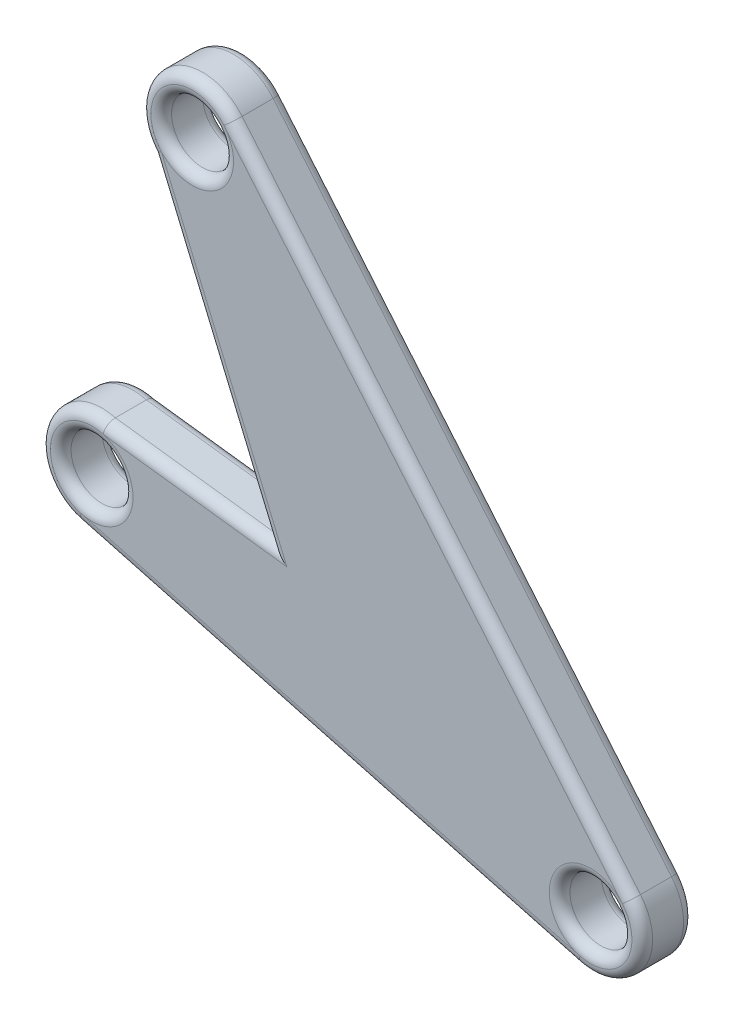
ISO-10303-21;
HEADER;
FILE_DESCRIPTION(('STEP AP214'),'2;1');
FILE_NAME('part.step','',(''),(''),'','','');
FILE_SCHEMA(('AUTOMOTIVE_DESIGN { 1 0 10303 214 1 1 1 1 }'));
ENDSEC;
DATA;
#1=APPLICATION_CONTEXT('core data for automotive mechanical design processes');
#2=APPLICATION_PROTOCOL_DEFINITION('international standard','automotive_design',2000,#1);
#3=PRODUCT_CONTEXT('',#1,'mechanical');
#4=PRODUCT('Part','Part','',(#3));
#5=PRODUCT_RELATED_PRODUCT_CATEGORY('part','',(#4));
#6=PRODUCT_DEFINITION_FORMATION('','',#4);
#7=PRODUCT_DEFINITION_CONTEXT('part definition',#1,'design');
#8=PRODUCT_DEFINITION('design','',#6,#7);
#9=PRODUCT_DEFINITION_SHAPE('','',#8);
#10=(LENGTH_UNIT() NAMED_UNIT(*) SI_UNIT(.MILLI.,.METRE.));
#11=(NAMED_UNIT(*) PLANE_ANGLE_UNIT() SI_UNIT($,.RADIAN.));
#12=(NAMED_UNIT(*) SI_UNIT($,.STERADIAN.) SOLID_ANGLE_UNIT());
#13=UNCERTAINTY_MEASURE_WITH_UNIT(LENGTH_MEASURE(1.E-05),#10,'distance_accuracy_value','');
#14=(GEOMETRIC_REPRESENTATION_CONTEXT(3) GLOBAL_UNCERTAINTY_ASSIGNED_CONTEXT((#13)) GLOBAL_UNIT_ASSIGNED_CONTEXT((#10,
#11,#12)) REPRESENTATION_CONTEXT('',''));
#15=CARTESIAN_POINT('',(0.,0.,0.));
#16=DIRECTION('',(0.,0.,1.));
#17=DIRECTION('',(1.,0.,0.));
#18=AXIS2_PLACEMENT_3D('',#15,#16,#17);
#19=CARTESIAN_POINT('',(-0.647047612756279,-2.41481456572268,2.5));
#20=DIRECTION('',(0.258819045102511,0.965925826289071,0.));
#21=DIRECTION('',(-0.965925826289071,0.258819045102511,0.));
#22=AXIS2_PLACEMENT_3D('',#19,#20,#21);
#23=PLANE('',#22);
#24=DIRECTION('',(0.,0.,-1.));
#25=VECTOR('',#24,1.);
#26=CARTESIAN_POINT('',(-24.7951932699831,4.0556615618401,2.5));
#27=LINE('',#26,#25);
#28=CARTESIAN_POINT('',(-24.7951932699831,4.0556615618401,2.));
#29=VERTEX_POINT('',#28);
#30=CARTESIAN_POINT('',(-24.7951932699831,4.0556615618401,0.5));
#31=VERTEX_POINT('',#30);
#32=EDGE_CURVE('E432',#29,#31,#27,.T.);
#33=ORIENTED_EDGE('',*,*,#32,.T.);
#34=DIRECTION('',(0.965925826289071,-0.258819045102511,0.));
#35=VECTOR('',#34,1.);
#36=CARTESIAN_POINT('',(-0.647047612756279,-2.41481456572268,0.5));
#37=LINE('',#36,#35);
#38=CARTESIAN_POINT('',(-0.647047612756279,-2.41481456572268,0.5));
#39=VERTEX_POINT('',#38);
#40=EDGE_CURVE('E245',#31,#39,#37,.T.);
#41=ORIENTED_EDGE('',*,*,#40,.T.);
#42=DIRECTION('',(0.,0.,-1.));
#43=VECTOR('',#42,1.);
#44=CARTESIAN_POINT('',(-0.647047612756279,-2.41481456572268,2.5));
#45=LINE('',#44,#43);
#46=CARTESIAN_POINT('',(-0.647047612756279,-2.41481456572268,2.));
#47=VERTEX_POINT('',#46);
#48=EDGE_CURVE('E181',#47,#39,#45,.T.);
#49=ORIENTED_EDGE('',*,*,#48,.F.);
#50=DIRECTION('',(0.965925826289071,-0.258819045102511,0.));
#51=VECTOR('',#50,1.);
#52=CARTESIAN_POINT('',(-24.7951932699831,4.05566156184011,2.));
#53=LINE('',#52,#51);
#54=EDGE_CURVE('E243',#47,#29,#53,.F.);
#55=ORIENTED_EDGE('',*,*,#54,.T.);
#56=EDGE_LOOP('',(#33,#41,#49,#55));
#57=FACE_BOUND('',#56,.T.);
#58=ADVANCED_FACE('F43',(#57),#23,.F.);
#59=CARTESIAN_POINT('',(0.,0.,2.5));
#60=DIRECTION('',(0.,0.,-1.));
#61=DIRECTION('',(-1.,0.,0.));
#62=AXIS2_PLACEMENT_3D('',#59,#60,#61);
#63=CYLINDRICAL_SURFACE('',#62,2.5);
#64=ORIENTED_EDGE('',*,*,#48,.T.);
#65=CARTESIAN_POINT('',(0.,0.,0.5));
#66=DIRECTION('',(0.,0.,1.));
#67=DIRECTION('',(1.,0.,0.));
#68=AXIS2_PLACEMENT_3D('',#65,#66,#67);
#69=CIRCLE('',#68,2.5);
#70=CARTESIAN_POINT('',(1.91511110779743,1.60696902421637,0.5));
#71=VERTEX_POINT('',#70);
#72=EDGE_CURVE('E168',#39,#71,#69,.T.);
#73=ORIENTED_EDGE('',*,*,#72,.T.);
#74=DIRECTION('',(0.,0.,-1.));
#75=VECTOR('',#74,1.);
#76=CARTESIAN_POINT('',(1.91511110779743,1.60696902421637,2.5));
#77=LINE('',#76,#75);
#78=CARTESIAN_POINT('',(1.91511110779743,1.60696902421637,2.));
#79=VERTEX_POINT('',#78);
#80=EDGE_CURVE('E445',#79,#71,#77,.T.);
#81=ORIENTED_EDGE('',*,*,#80,.F.);
#82=CARTESIAN_POINT('',(0.,0.,2.));
#83=DIRECTION('',(0.,0.,1.));
#84=DIRECTION('',(1.,0.,0.));
#85=AXIS2_PLACEMENT_3D('',#82,#83,#84);
#86=CIRCLE('',#85,2.5);
#87=EDGE_CURVE('E219',#79,#47,#86,.F.);
#88=ORIENTED_EDGE('',*,*,#87,.T.);
#89=EDGE_LOOP('',(#64,#73,#81,#88));
#90=FACE_BOUND('',#89,.T.);
#91=ADVANCED_FACE('F369',(#90),#63,.T.);
#92=CARTESIAN_POINT('',(1.91511110779743,1.60696902421637,2.5));
#93=DIRECTION('',(-0.766044443118973,-0.642787609686546,0.));
#94=DIRECTION('',(0.642787609686546,-0.766044443118973,0.));
#95=AXIS2_PLACEMENT_3D('',#92,#93,#94);
#96=PLANE('',#95);
#97=ORIENTED_EDGE('',*,*,#80,.T.);
#98=DIRECTION('',(-0.642787609686546,0.766044443118973,0.));
#99=VECTOR('',#98,1.);
#100=CARTESIAN_POINT('',(1.91511110779743,1.60696902421637,0.5));
#101=LINE('',#100,#99);
#102=CARTESIAN_POINT('',(-17.3685171827989,24.5883023177855,0.5));
#103=VERTEX_POINT('',#102);
#104=EDGE_CURVE('E224',#71,#103,#101,.T.);
#105=ORIENTED_EDGE('',*,*,#104,.T.);
#106=DIRECTION('',(0.,0.,-1.));
#107=VECTOR('',#106,1.);
#108=CARTESIAN_POINT('',(-17.3685171827989,24.5883023177855,2.5));
#109=LINE('',#108,#107);
#110=CARTESIAN_POINT('',(-17.3685171827989,24.5883023177855,2.));
#111=VERTEX_POINT('',#110);
#112=EDGE_CURVE('E442',#111,#103,#109,.T.);
#113=ORIENTED_EDGE('',*,*,#112,.F.);
#114=DIRECTION('',(-0.642787609686546,0.766044443118973,0.));
#115=VECTOR('',#114,1.);
#116=CARTESIAN_POINT('',(1.91511110779743,1.60696902421637,2.));
#117=LINE('',#116,#115);
#118=EDGE_CURVE('E222',#111,#79,#117,.F.);
#119=ORIENTED_EDGE('',*,*,#118,.T.);
#120=EDGE_LOOP('',(#97,#105,#113,#119));
#121=FACE_BOUND('',#120,.T.);
#122=ADVANCED_FACE('F375',(#121),#96,.F.);
#123=CARTESIAN_POINT('',(-19.2836282905964,22.9813332935692,2.5));
#124=DIRECTION('',(0.,0.,-1.));
#125=DIRECTION('',(-1.,0.,0.));
#126=AXIS2_PLACEMENT_3D('',#123,#124,#125);
#127=CYLINDRICAL_SURFACE('',#126,2.5);
#128=ORIENTED_EDGE('',*,*,#112,.T.);
#129=CARTESIAN_POINT('',(-19.2836282905964,22.9813332935692,0.5));
#130=DIRECTION('',(0.,0.,1.));
#131=DIRECTION('',(1.,0.,0.));
#132=AXIS2_PLACEMENT_3D('',#129,#130,#131);
#133=CIRCLE('',#132,2.5);
#134=CARTESIAN_POINT('',(-21.1987393983938,21.3743642693528,0.5));
#135=VERTEX_POINT('',#134);
#136=EDGE_CURVE('E228',#103,#135,#133,.T.);
#137=ORIENTED_EDGE('',*,*,#136,.T.);
#138=DIRECTION('',(0.,0.,-1.));
#139=VECTOR('',#138,1.);
#140=CARTESIAN_POINT('',(-21.1987393983938,21.3743642693528,2.5));
#141=LINE('',#140,#139);
#142=CARTESIAN_POINT('',(-21.1987393983938,21.3743642693528,2.));
#143=VERTEX_POINT('',#142);
#144=EDGE_CURVE('E413',#143,#135,#141,.T.);
#145=ORIENTED_EDGE('',*,*,#144,.F.);
#146=CARTESIAN_POINT('',(-19.2836282905964,22.9813332935692,2.));
#147=DIRECTION('',(0.,0.,1.));
#148=DIRECTION('',(1.,0.,0.));
#149=AXIS2_PLACEMENT_3D('',#146,#147,#148);
#150=CIRCLE('',#149,2.5);
#151=EDGE_CURVE('E226',#143,#111,#150,.F.);
#152=ORIENTED_EDGE('',*,*,#151,.T.);
#153=EDGE_LOOP('',(#128,#137,#145,#152));
#154=FACE_BOUND('',#153,.T.);
#155=ADVANCED_FACE('F493',(#154),#127,.T.);
#156=CARTESIAN_POINT('',(-10.3243914845816,-4.3622991514506,2.5));
#157=DIRECTION('',(-0.921150047944264,-0.38920764274649,0.));
#158=DIRECTION('',(0.38920764274649,-0.921150047944264,0.));
#159=AXIS2_PLACEMENT_3D('',#156,#157,#158);
#160=PLANE('',#159);
#161=ORIENTED_EDGE('',*,*,#144,.T.);
#162=DIRECTION('',(-0.38920764274649,0.921150047944264,0.));
#163=VECTOR('',#162,1.);
#164=CARTESIAN_POINT('',(-15.5010980444705,7.88957612567752,0.5));
#165=LINE('',#164,#163);
#166=CARTESIAN_POINT('',(-15.5010980444705,7.88957612567752,0.5));
#167=VERTEX_POINT('',#166);
#168=EDGE_CURVE('E232',#135,#167,#165,.F.);
#169=ORIENTED_EDGE('',*,*,#168,.T.);
#170=DIRECTION('',(0.,0.,-1.));
#171=VECTOR('',#170,1.);
#172=CARTESIAN_POINT('',(-15.5010980444705,7.88957612567752,2.5));
#173=LINE('',#172,#171);
#174=CARTESIAN_POINT('',(-15.5010980444705,7.88957612567752,2.));
#175=VERTEX_POINT('',#174);
#176=EDGE_CURVE('E410',#175,#167,#173,.T.);
#177=ORIENTED_EDGE('',*,*,#176,.F.);
#178=DIRECTION('',(-0.38920764274649,0.921150047944264,0.));
#179=VECTOR('',#178,1.);
#180=CARTESIAN_POINT('',(-10.3243914845816,-4.3622991514506,2.));
#181=LINE('',#180,#179);
#182=EDGE_CURVE('E230',#175,#143,#181,.T.);
#183=ORIENTED_EDGE('',*,*,#182,.T.);
#184=EDGE_LOOP('',(#161,#169,#177,#183));
#185=FACE_BOUND('',#184,.T.);
#186=ADVANCED_FACE('F409',(#185),#160,.T.);
#187=CARTESIAN_POINT('',(0.73052076796544,5.86931871225232,2.5));
#188=DIRECTION('',(0.123511318006618,0.992343163590231,0.));
#189=DIRECTION('',(-0.992343163590231,0.123511318006618,0.));
#190=AXIS2_PLACEMENT_3D('',#187,#188,#189);
#191=PLANE('',#190);
#192=ORIENTED_EDGE('',*,*,#176,.T.);
#193=DIRECTION('',(0.992343163590231,-0.123511318006618,0.));
#194=VECTOR('',#193,1.);
#195=CARTESIAN_POINT('',(-23.5010980444705,8.88529069328546,0.5));
#196=LINE('',#195,#194);
#197=CARTESIAN_POINT('',(-23.5010980444705,8.88529069328546,0.5));
#198=VERTEX_POINT('',#197);
#199=EDGE_CURVE('E236',#167,#198,#196,.F.);
#200=ORIENTED_EDGE('',*,*,#199,.T.);
#201=DIRECTION('',(0.,0.,-1.));
#202=VECTOR('',#201,1.);
#203=CARTESIAN_POINT('',(-23.5010980444705,8.88529069328546,2.5));
#204=LINE('',#203,#202);
#205=CARTESIAN_POINT('',(-23.5010980444705,8.88529069328546,2.));
#206=VERTEX_POINT('',#205);
#207=EDGE_CURVE('E420',#206,#198,#204,.T.);
#208=ORIENTED_EDGE('',*,*,#207,.F.);
#209=DIRECTION('',(0.992343163590231,-0.123511318006618,0.));
#210=VECTOR('',#209,1.);
#211=CARTESIAN_POINT('',(0.73052076796544,5.86931871225232,2.));
#212=LINE('',#211,#210);
#213=EDGE_CURVE('E234',#206,#175,#212,.T.);
#214=ORIENTED_EDGE('',*,*,#213,.T.);
#215=EDGE_LOOP('',(#192,#200,#208,#214));
#216=FACE_BOUND('',#215,.T.);
#217=ADVANCED_FACE('F416',(#216),#191,.T.);
#218=CARTESIAN_POINT('',(-24.1481456572268,6.47047612756278,2.5));
#219=DIRECTION('',(0.,0.,-1.));
#220=DIRECTION('',(-1.,0.,0.));
#221=AXIS2_PLACEMENT_3D('',#218,#219,#220);
#222=CYLINDRICAL_SURFACE('',#221,1.5);
#223=CARTESIAN_POINT('',(-24.1481456572268,6.47047612756278,0.5));
#224=DIRECTION('',(0.,0.,1.));
#225=DIRECTION('',(1.,0.,0.));
#226=AXIS2_PLACEMENT_3D('',#223,#224,#225);
#227=CIRCLE('',#226,1.5);
#228=CARTESIAN_POINT('',(-22.6481456572268,6.47047612756278,0.5));
#229=VERTEX_POINT('',#228);
#230=EDGE_CURVE('E210',#229,#229,#227,.F.);
#231=ORIENTED_EDGE('',*,*,#230,.T.);
#232=EDGE_LOOP('',(#231));
#233=FACE_BOUND('',#232,.T.);
#234=CARTESIAN_POINT('',(-24.1481456572268,6.47047612756278,2.));
#235=DIRECTION('',(0.,0.,1.));
#236=DIRECTION('',(1.,0.,0.));
#237=AXIS2_PLACEMENT_3D('',#234,#235,#236);
#238=CIRCLE('',#237,1.5);
#239=CARTESIAN_POINT('',(-22.6481456572268,6.47047612756278,2.));
#240=VERTEX_POINT('',#239);
#241=EDGE_CURVE('E207',#240,#240,#238,.T.);
#242=ORIENTED_EDGE('',*,*,#241,.T.);
#243=EDGE_LOOP('',(#242));
#244=FACE_BOUND('',#243,.T.);
#245=ADVANCED_FACE('F504',(#233,#244),#222,.F.);
#246=CARTESIAN_POINT('',(-19.2836282905964,22.9813332935692,2.5));
#247=DIRECTION('',(0.,0.,-1.));
#248=DIRECTION('',(-1.,0.,0.));
#249=AXIS2_PLACEMENT_3D('',#246,#247,#248);
#250=CYLINDRICAL_SURFACE('',#249,1.5);
#251=CARTESIAN_POINT('',(-19.2836282905964,22.9813332935692,0.5));
#252=DIRECTION('',(0.,0.,1.));
#253=DIRECTION('',(1.,0.,0.));
#254=AXIS2_PLACEMENT_3D('',#251,#252,#253);
#255=CIRCLE('',#254,1.5);
#256=CARTESIAN_POINT('',(-17.7836282905964,22.9813332935692,0.5));
#257=VERTEX_POINT('',#256);
#258=EDGE_CURVE('E216',#257,#257,#255,.F.);
#259=ORIENTED_EDGE('',*,*,#258,.T.);
#260=EDGE_LOOP('',(#259));
#261=FACE_BOUND('',#260,.T.);
#262=CARTESIAN_POINT('',(-19.2836282905964,22.9813332935692,2.));
#263=DIRECTION('',(0.,0.,1.));
#264=DIRECTION('',(1.,0.,0.));
#265=AXIS2_PLACEMENT_3D('',#262,#263,#264);
#266=CIRCLE('',#265,1.5);
#267=CARTESIAN_POINT('',(-17.7836282905964,22.9813332935692,2.));
#268=VERTEX_POINT('',#267);
#269=EDGE_CURVE('E213',#268,#268,#266,.T.);
#270=ORIENTED_EDGE('',*,*,#269,.T.);
#271=EDGE_LOOP('',(#270));
#272=FACE_BOUND('',#271,.T.);
#273=ADVANCED_FACE('F508',(#261,#272),#250,.F.);
#274=CARTESIAN_POINT('',(-24.1481456572268,6.47047612756278,2.5));
#275=DIRECTION('',(0.,0.,-1.));
#276=DIRECTION('',(-1.,0.,0.));
#277=AXIS2_PLACEMENT_3D('',#274,#275,#276);
#278=CYLINDRICAL_SURFACE('',#277,2.5);
#279=ORIENTED_EDGE('',*,*,#207,.T.);
#280=CARTESIAN_POINT('',(-24.1481456572268,6.47047612756278,0.5));
#281=DIRECTION('',(0.,0.,1.));
#282=DIRECTION('',(1.,0.,0.));
#283=AXIS2_PLACEMENT_3D('',#280,#281,#282);
#284=CIRCLE('',#283,2.5);
#285=EDGE_CURVE('E241',#198,#31,#284,.T.);
#286=ORIENTED_EDGE('',*,*,#285,.T.);
#287=ORIENTED_EDGE('',*,*,#32,.F.);
#288=CARTESIAN_POINT('',(-24.1481456572268,6.47047612756278,2.));
#289=DIRECTION('',(0.,0.,1.));
#290=DIRECTION('',(1.,0.,0.));
#291=AXIS2_PLACEMENT_3D('',#288,#289,#290);
#292=CIRCLE('',#291,2.5);
#293=EDGE_CURVE('E238',#29,#206,#292,.F.);
#294=ORIENTED_EDGE('',*,*,#293,.T.);
#295=EDGE_LOOP('',(#279,#286,#287,#294));
#296=FACE_BOUND('',#295,.T.);
#297=ADVANCED_FACE('F431',(#296),#278,.T.);
#298=CARTESIAN_POINT('',(0.,0.,2.5));
#299=DIRECTION('',(0.,0.,-1.));
#300=DIRECTION('',(-1.,0.,0.));
#301=AXIS2_PLACEMENT_3D('',#298,#299,#300);
#302=CYLINDRICAL_SURFACE('',#301,1.5);
#303=CARTESIAN_POINT('',(0.,0.,0.5));
#304=DIRECTION('',(0.,0.,1.));
#305=DIRECTION('',(1.,0.,0.));
#306=AXIS2_PLACEMENT_3D('',#303,#304,#305);
#307=CIRCLE('',#306,1.5);
#308=CARTESIAN_POINT('',(1.5,0.,0.5));
#309=VERTEX_POINT('',#308);
#310=EDGE_CURVE('E204',#309,#309,#307,.F.);
#311=ORIENTED_EDGE('',*,*,#310,.T.);
#312=EDGE_LOOP('',(#311));
#313=FACE_BOUND('',#312,.T.);
#314=CARTESIAN_POINT('',(0.,0.,2.));
#315=DIRECTION('',(0.,0.,1.));
#316=DIRECTION('',(1.,0.,0.));
#317=AXIS2_PLACEMENT_3D('',#314,#315,#316);
#318=CIRCLE('',#317,1.5);
#319=CARTESIAN_POINT('',(1.5,0.,2.));
#320=VERTEX_POINT('',#319);
#321=EDGE_CURVE('E201',#320,#320,#318,.T.);
#322=ORIENTED_EDGE('',*,*,#321,.T.);
#323=EDGE_LOOP('',(#322));
#324=FACE_BOUND('',#323,.T.);
#325=ADVANCED_FACE('F507',(#313,#324),#302,.F.);
#326=CARTESIAN_POINT('',(0.,0.,2.5));
#327=DIRECTION('',(0.,0.,1.));
#328=DIRECTION('',(1.,0.,0.));
#329=AXIS2_PLACEMENT_3D('',#326,#327,#328);
#330=PLANE('',#329);
#331=DIRECTION('',(-0.38920764274649,0.921150047944264,0.));
#332=VECTOR('',#331,1.);
#333=CARTESIAN_POINT('',(-9.86381646060947,-4.16769533007736,2.5));
#334=LINE('',#333,#332);
#335=CARTESIAN_POINT('',(-20.7690839423935,21.6421464109631,2.5));
#336=VERTEX_POINT('',#335);
#337=CARTESIAN_POINT('',(-14.7034593145328,7.28644060483377,2.5));
#338=VERTEX_POINT('',#337);
#339=EDGE_CURVE('E52',#336,#338,#334,.F.);
#340=ORIENTED_EDGE('',*,*,#339,.T.);
#341=DIRECTION('',(0.992343163590231,-0.123511318006618,0.));
#342=VECTOR('',#341,1.);
#343=CARTESIAN_POINT('',(0.668765108962131,5.37314713045721,2.5));
#344=LINE('',#343,#342);
#345=CARTESIAN_POINT('',(-23.5990577101027,8.39362521859112,2.5));
#346=VERTEX_POINT('',#345);
#347=EDGE_CURVE('E11',#338,#346,#344,.F.);
#348=ORIENTED_EDGE('',*,*,#347,.T.);
#349=CARTESIAN_POINT('',(-24.1481456572268,6.47047612756278,2.5));
#350=DIRECTION('',(0.,0.,1.));
#351=DIRECTION('',(1.,0.,0.));
#352=AXIS2_PLACEMENT_3D('',#349,#350,#351);
#353=CIRCLE('',#352,2.);
#354=CARTESIAN_POINT('',(-22.1481456572268,6.47047612756278,2.5));
#355=VERTEX_POINT('',#354);
#356=EDGE_CURVE('E260',#346,#355,#353,.F.);
#357=ORIENTED_EDGE('',*,*,#356,.T.);
#358=CARTESIAN_POINT('',(-24.1481456572268,6.47047612756278,2.5));
#359=DIRECTION('',(0.,0.,1.));
#360=DIRECTION('',(1.,0.,0.));
#361=AXIS2_PLACEMENT_3D('',#358,#359,#360);
#362=CIRCLE('',#361,2.);
#363=CARTESIAN_POINT('',(-24.6657837474318,4.53862447498464,2.5));
#364=VERTEX_POINT('',#363);
#365=EDGE_CURVE('E249',#355,#364,#362,.F.);
#366=ORIENTED_EDGE('',*,*,#365,.T.);
#367=DIRECTION('',(0.965925826289071,-0.258819045102511,0.));
#368=VECTOR('',#367,1.);
#369=CARTESIAN_POINT('',(-0.517638090205023,-1.93185165257814,2.5));
#370=LINE('',#369,#368);
#371=CARTESIAN_POINT('',(-0.517638090205023,-1.93185165257814,2.5));
#372=VERTEX_POINT('',#371);
#373=EDGE_CURVE('E247',#364,#372,#370,.T.);
#374=ORIENTED_EDGE('',*,*,#373,.T.);
#375=CARTESIAN_POINT('',(0.,0.,2.5));
#376=DIRECTION('',(0.,0.,1.));
#377=DIRECTION('',(1.,0.,0.));
#378=AXIS2_PLACEMENT_3D('',#375,#376,#377);
#379=CIRCLE('',#378,2.);
#380=CARTESIAN_POINT('',(1.53208888623795,1.28557521937309,2.5));
#381=VERTEX_POINT('',#380);
#382=EDGE_CURVE('E251',#372,#381,#379,.F.);
#383=ORIENTED_EDGE('',*,*,#382,.T.);
#384=DIRECTION('',(-0.642787609686546,0.766044443118973,0.));
#385=VECTOR('',#384,1.);
#386=CARTESIAN_POINT('',(-17.7515394043584,24.2669085129423,2.5));
#387=LINE('',#386,#385);
#388=CARTESIAN_POINT('',(-17.7515394043584,24.2669085129423,2.5));
#389=VERTEX_POINT('',#388);
#390=EDGE_CURVE('E254',#381,#389,#387,.T.);
#391=ORIENTED_EDGE('',*,*,#390,.T.);
#392=CARTESIAN_POINT('',(-19.2836282905964,22.9813332935692,2.5));
#393=DIRECTION('',(0.,0.,1.));
#394=DIRECTION('',(1.,0.,0.));
#395=AXIS2_PLACEMENT_3D('',#392,#393,#394);
#396=CIRCLE('',#395,2.);
#397=CARTESIAN_POINT('',(-17.2836282905964,22.9813332935692,2.5));
#398=VERTEX_POINT('',#397);
#399=EDGE_CURVE('E256',#389,#398,#396,.F.);
#400=ORIENTED_EDGE('',*,*,#399,.T.);
#401=CARTESIAN_POINT('',(-19.2836282905964,22.9813332935692,2.5));
#402=DIRECTION('',(0.,0.,1.));
#403=DIRECTION('',(1.,0.,0.));
#404=AXIS2_PLACEMENT_3D('',#401,#402,#403);
#405=CIRCLE('',#404,2.);
#406=EDGE_CURVE('E258',#398,#336,#405,.F.);
#407=ORIENTED_EDGE('',*,*,#406,.T.);
#408=EDGE_LOOP('',(#340,#348,#357,#366,#374,#383,#391,#400,#407));
#409=FACE_BOUND('',#408,.T.);
#410=ADVANCED_FACE('F475',(#409),#330,.T.);
#411=CARTESIAN_POINT('',(0.,0.,0.));
#412=DIRECTION('',(0.,0.,1.));
#413=DIRECTION('',(1.,0.,0.));
#414=AXIS2_PLACEMENT_3D('',#411,#412,#413);
#415=PLANE('',#414);
#416=CARTESIAN_POINT('',(-19.2836282905964,22.9813332935692,0.));
#417=DIRECTION('',(0.,0.,1.));
#418=DIRECTION('',(1.,0.,0.));
#419=AXIS2_PLACEMENT_3D('',#416,#417,#418);
#420=CIRCLE('',#419,2.);
#421=CARTESIAN_POINT('',(-20.7690839423934,21.6421464109631,0.));
#422=VERTEX_POINT('',#421);
#423=CARTESIAN_POINT('',(-17.2836282905964,22.9813332935692,0.));
#424=VERTEX_POINT('',#423);
#425=EDGE_CURVE('E197',#422,#424,#420,.T.);
#426=ORIENTED_EDGE('',*,*,#425,.T.);
#427=CARTESIAN_POINT('',(-19.2836282905964,22.9813332935692,0.));
#428=DIRECTION('',(0.,0.,1.));
#429=DIRECTION('',(1.,0.,0.));
#430=AXIS2_PLACEMENT_3D('',#427,#428,#429);
#431=CIRCLE('',#430,2.);
#432=CARTESIAN_POINT('',(-17.7515394043584,24.2669085129423,0.));
#433=VERTEX_POINT('',#432);
#434=EDGE_CURVE('E199',#424,#433,#431,.T.);
#435=ORIENTED_EDGE('',*,*,#434,.T.);
#436=DIRECTION('',(-0.642787609686546,0.766044443118973,0.));
#437=VECTOR('',#436,1.);
#438=CARTESIAN_POINT('',(1.53208888623795,1.28557521937309,0.));
#439=LINE('',#438,#437);
#440=CARTESIAN_POINT('',(1.53208888623795,1.28557521937309,0.));
#441=VERTEX_POINT('',#440);
#442=EDGE_CURVE('E185',#433,#441,#439,.F.);
#443=ORIENTED_EDGE('',*,*,#442,.T.);
#444=CARTESIAN_POINT('',(0.,0.,0.));
#445=DIRECTION('',(0.,0.,1.));
#446=DIRECTION('',(1.,0.,0.));
#447=AXIS2_PLACEMENT_3D('',#444,#445,#446);
#448=CIRCLE('',#447,2.);
#449=CARTESIAN_POINT('',(-0.517638090205023,-1.93185165257814,0.));
#450=VERTEX_POINT('',#449);
#451=EDGE_CURVE('E158',#441,#450,#448,.T.);
#452=ORIENTED_EDGE('',*,*,#451,.T.);
#453=DIRECTION('',(0.965925826289071,-0.258819045102511,0.));
#454=VECTOR('',#453,1.);
#455=CARTESIAN_POINT('',(-0.517638090205023,-1.93185165257814,0.));
#456=LINE('',#455,#454);
#457=CARTESIAN_POINT('',(-24.6657837474318,4.53862447498464,0.));
#458=VERTEX_POINT('',#457);
#459=EDGE_CURVE('E174',#450,#458,#456,.F.);
#460=ORIENTED_EDGE('',*,*,#459,.T.);
#461=CARTESIAN_POINT('',(-24.1481456572268,6.47047612756278,0.));
#462=DIRECTION('',(0.,0.,1.));
#463=DIRECTION('',(1.,0.,0.));
#464=AXIS2_PLACEMENT_3D('',#461,#462,#463);
#465=CIRCLE('',#464,2.);
#466=CARTESIAN_POINT('',(-22.1481456572268,6.47047612756278,0.));
#467=VERTEX_POINT('',#466);
#468=EDGE_CURVE('E180',#458,#467,#465,.T.);
#469=ORIENTED_EDGE('',*,*,#468,.T.);
#470=CARTESIAN_POINT('',(-24.1481456572268,6.47047612756278,0.));
#471=DIRECTION('',(0.,0.,1.));
#472=DIRECTION('',(1.,0.,0.));
#473=AXIS2_PLACEMENT_3D('',#470,#471,#472);
#474=CIRCLE('',#473,2.);
#475=CARTESIAN_POINT('',(-23.5990577101027,8.39362521859112,0.));
#476=VERTEX_POINT('',#475);
#477=EDGE_CURVE('E188',#467,#476,#474,.T.);
#478=ORIENTED_EDGE('',*,*,#477,.T.);
#479=DIRECTION('',(0.992343163590231,-0.123511318006618,0.));
#480=VECTOR('',#479,1.);
#481=CARTESIAN_POINT('',(-15.5628537034738,7.3934045438824,0.));
#482=LINE('',#481,#480);
#483=CARTESIAN_POINT('',(-14.7034593145328,7.28644060483377,0.));
#484=VERTEX_POINT('',#483);
#485=EDGE_CURVE('E187',#476,#484,#482,.T.);
#486=ORIENTED_EDGE('',*,*,#485,.T.);
#487=DIRECTION('',(-0.38920764274649,0.921150047944264,0.));
#488=VECTOR('',#487,1.);
#489=CARTESIAN_POINT('',(-20.7381643744217,21.5689680907261,0.));
#490=LINE('',#489,#488);
#491=EDGE_CURVE('E190',#484,#422,#490,.T.);
#492=ORIENTED_EDGE('',*,*,#491,.T.);
#493=EDGE_LOOP('',(#426,#435,#443,#452,#460,#469,#478,#486,#492));
#494=FACE_BOUND('',#493,.T.);
#495=ADVANCED_FACE('F183',(#494),#415,.F.);
#496=CARTESIAN_POINT('',(-24.1481456572268,6.47047612756278,0.5));
#497=DIRECTION('',(0.,0.,1.));
#498=DIRECTION('',(1.,0.,0.));
#499=AXIS2_PLACEMENT_3D('',#496,#497,#498);
#500=TOROIDAL_SURFACE('',#499,2.,0.5);
#501=ORIENTED_EDGE('',*,*,#230,.F.);
#502=EDGE_LOOP('',(#501));
#503=FACE_BOUND('',#502,.T.);
#504=ORIENTED_EDGE('',*,*,#477,.F.);
#505=ORIENTED_EDGE('',*,*,#468,.F.);
#506=CARTESIAN_POINT('',(-24.1481456572268,6.47047612756278,0.));
#507=DIRECTION('',(0.,0.,1.));
#508=DIRECTION('',(1.,0.,0.));
#509=AXIS2_PLACEMENT_3D('',#506,#507,#508);
#510=CIRCLE('',#509,2.);
#511=EDGE_CURVE('E428',#476,#458,#510,.T.);
#512=ORIENTED_EDGE('',*,*,#511,.F.);
#513=EDGE_LOOP('',(#504,#505,#512));
#514=FACE_BOUND('',#513,.T.);
#515=ADVANCED_FACE('F298',(#503,#514),#500,.T.);
#516=CARTESIAN_POINT('',(0.668765108962131,5.3731471304572,0.5));
#517=DIRECTION('',(-0.992343163590231,0.123511318006618,0.));
#518=DIRECTION('',(-0.123511318006618,-0.992343163590231,0.));
#519=AXIS2_PLACEMENT_3D('',#516,#517,#518);
#520=CYLINDRICAL_SURFACE('',#519,0.5);
#521=CARTESIAN_POINT('',(-23.5010980444705,8.88529069328546,0.5));
#522=CARTESIAN_POINT('',(-23.5010938833701,8.8853144821809,0.471921806913941));
#523=CARTESIAN_POINT('',(-23.5015520689323,8.88296526545518,0.44385110670835));
#524=CARTESIAN_POINT('',(-23.5033623917296,8.87369643456932,0.388525710247552));
#525=CARTESIAN_POINT('',(-23.5047138325428,8.86678038092381,0.361270395570867));
#526=CARTESIAN_POINT('',(-23.508280826821,8.84854882288398,0.308318532239618));
#527=CARTESIAN_POINT('',(-23.5104967749958,8.83723130891379,0.282622701803267));
#528=CARTESIAN_POINT('',(-23.5157336333359,8.81053326681037,0.233534752434817));
#529=CARTESIAN_POINT('',(-23.5187543632857,8.79515364831367,0.210142119350326));
#530=CARTESIAN_POINT('',(-23.5255263208609,8.76075349846687,0.166292947430626));
#531=CARTESIAN_POINT('',(-23.5292782228485,8.74172960626961,0.14583914958009));
#532=CARTESIAN_POINT('',(-23.5374147622687,8.7005863718699,0.108460952890967));
#533=CARTESIAN_POINT('',(-23.5417996262121,8.67846592162355,0.0915378228562871));
#534=CARTESIAN_POINT('',(-23.55109759328,8.63170834455777,0.0616647507819959));
#535=CARTESIAN_POINT('',(-23.5560120287544,8.60706487822571,0.0487251616174226));
#536=CARTESIAN_POINT('',(-23.5662280024042,8.55601914888225,0.0272478960013126));
#537=CARTESIAN_POINT('',(-23.5715291721049,8.52961856207931,0.0187060903610008));
#538=CARTESIAN_POINT('',(-23.5801908563057,8.48664885168124,0.00875106718894563));
#539=CARTESIAN_POINT('',(-23.5834751901741,8.47039212285706,0.00585258859189021));
#540=CARTESIAN_POINT('',(-23.5900969568751,8.43769419621765,0.00173355688370045));
#541=CARTESIAN_POINT('',(-23.5934343061254,8.42125329889153,0.000510585316313192));
#542=CARTESIAN_POINT('',(-23.5975398942516,8.40107774368911,4.30399372816529E-05));
#543=CARTESIAN_POINT('',(-23.5982986555292,8.39735114548823,-1.15927487115122E-07));
#544=CARTESIAN_POINT('',(-23.5990577101027,8.39362521859112,0.));
#545=B_SPLINE_CURVE_WITH_KNOTS('',3,(#521,#522,#523,#524,#525,#526,#527,#528,#529,#530,#531,
#532,#533,#534,#535,#536,#537,#538,#539,#540,#541,#542,#543,#544),.UNSPECIFIED.,.F.,.F.,(4,2,2,
2,2,2,2,2,2,2,2,4),(0.,0.0841219473683584,0.168178386739281,0.252273248920518,0.33634929548612,
0.420503255808698,0.504687406354436,0.589088532302605,0.673410266740004,0.723847970180073,
0.774212793977795,0.785621574040832),.UNSPECIFIED.);
#546=EDGE_CURVE('E279',#198,#476,#545,.T.);
#547=ORIENTED_EDGE('',*,*,#546,.F.);
#548=ORIENTED_EDGE('',*,*,#199,.F.);
#549=CARTESIAN_POINT('',(-14.7034593145328,7.28644060483377,0.5));
#550=DIRECTION('',(-0.603135520843743,-0.79763872993765,0.));
#551=DIRECTION('',(0.79763872993765,-0.603135520843743,0.));
#552=AXIS2_PLACEMENT_3D('',#549,#550,#551);
#553=ELLIPSE('',#552,1.,0.5);
#554=EDGE_CURVE('E404',#484,#167,#553,.F.);
#555=ORIENTED_EDGE('',*,*,#554,.F.);
#556=ORIENTED_EDGE('',*,*,#485,.F.);
#557=EDGE_LOOP('',(#547,#548,#555,#556));
#558=FACE_BOUND('',#557,.T.);
#559=ADVANCED_FACE('F294',(#558),#520,.T.);
#560=CARTESIAN_POINT('',(-9.86381646060947,-4.16769533007736,0.5));
#561=DIRECTION('',(0.38920764274649,-0.921150047944264,0.));
#562=DIRECTION('',(0.921150047944264,0.38920764274649,0.));
#563=AXIS2_PLACEMENT_3D('',#560,#561,#562);
#564=CYLINDRICAL_SURFACE('',#563,0.5);
#565=ORIENTED_EDGE('',*,*,#554,.T.);
#566=ORIENTED_EDGE('',*,*,#168,.F.);
#567=CARTESIAN_POINT('',(-21.1987393983938,21.3743642693528,0.5));
#568=CARTESIAN_POINT('',(-21.1987613111234,21.3743520499942,0.472104931697821));
#569=CARTESIAN_POINT('',(-21.1967269557181,21.3755952311417,0.444218673816136));
#570=CARTESIAN_POINT('',(-21.1887087880469,21.3805013409038,0.389265836550666));
#571=CARTESIAN_POINT('',(-21.1827289851629,21.3841618130595,0.36219845419499));
#572=CARTESIAN_POINT('',(-21.1669794219551,21.3938136116469,0.30961574547062));
#573=CARTESIAN_POINT('',(-21.1572082301608,21.3998058184469,0.284101009530687));
#574=CARTESIAN_POINT('',(-21.1341824422443,21.4139495155612,0.235350201415234));
#575=CARTESIAN_POINT('',(-21.1209283816723,21.4221006739017,0.212113779663968));
#576=CARTESIAN_POINT('',(-21.0912644453071,21.4403814138428,0.168453895014488));
#577=CARTESIAN_POINT('',(-21.0748406194398,21.4505197441411,0.148043578187957));
#578=CARTESIAN_POINT('',(-21.0393565464487,21.472478507098,0.110705478350402));
#579=CARTESIAN_POINT('',(-21.0202954025658,21.4842995119508,0.0937788847895962));
#580=CARTESIAN_POINT('',(-20.9798772003314,21.5094377392932,0.0636991737452818));
#581=CARTESIAN_POINT('',(-20.9584975135784,21.5227697788919,0.0505889067890171));
#582=CARTESIAN_POINT('',(-20.9142368307195,21.5504609232738,0.028737302728095));
#583=CARTESIAN_POINT('',(-20.8913568713012,21.564819319451,0.0199929840081482));
#584=CARTESIAN_POINT('',(-20.8528943482349,21.5890433069824,0.00933393232800295));
#585=CARTESIAN_POINT('',(-20.8375491672939,21.5987296957779,0.00610096169636814));
#586=CARTESIAN_POINT('',(-20.8066911266574,21.6182557554001,0.00160497043302799));
#587=CARTESIAN_POINT('',(-20.7911785731284,21.6280951573716,0.000338818849315833));
#588=CARTESIAN_POINT('',(-20.7734779411964,21.639350808254,1.9737046976369E-05));
#589=CARTESIAN_POINT('',(-20.7712806980774,21.6407485123817,-5.23153835675385E-08));
#590=CARTESIAN_POINT('',(-20.7690839423935,21.6421464109631,0.));
#591=B_SPLINE_CURVE_WITH_KNOTS('',3,(#567,#568,#569,#570,#571,#572,#573,#574,#575,#576,#577,
#578,#579,#580,#581,#582,#583,#584,#585,#586,#587,#588,#589,#590),.UNSPECIFIED.,.F.,.F.,(4,2,2,
2,2,2,2,2,2,2,2,4),(0.,0.0835705630772625,0.167056331894426,0.250573652179199,0.334078137768864,
0.417958869316306,0.501868192986268,0.586686223820726,0.671446250799191,0.726650733592722,
0.781767246747706,0.789579487341142),.UNSPECIFIED.);
#592=EDGE_CURVE('E270',#422,#135,#591,.F.);
#593=ORIENTED_EDGE('',*,*,#592,.F.);
#594=ORIENTED_EDGE('',*,*,#491,.F.);
#595=EDGE_LOOP('',(#565,#566,#593,#594));
#596=FACE_BOUND('',#595,.T.);
#597=ADVANCED_FACE('F290',(#596),#564,.T.);
#598=CARTESIAN_POINT('',(-19.2836282905964,22.9813332935692,0.5));
#599=DIRECTION('',(0.,0.,1.));
#600=DIRECTION('',(1.,0.,0.));
#601=AXIS2_PLACEMENT_3D('',#598,#599,#600);
#602=TOROIDAL_SURFACE('',#601,2.,0.5);
#603=ORIENTED_EDGE('',*,*,#258,.F.);
#604=EDGE_LOOP('',(#603));
#605=FACE_BOUND('',#604,.T.);
#606=ORIENTED_EDGE('',*,*,#434,.F.);
#607=ORIENTED_EDGE('',*,*,#425,.F.);
#608=CARTESIAN_POINT('',(-19.2836282905964,22.9813332935692,0.));
#609=DIRECTION('',(0.,0.,1.));
#610=DIRECTION('',(1.,0.,0.));
#611=AXIS2_PLACEMENT_3D('',#608,#609,#610);
#612=CIRCLE('',#611,2.);
#613=EDGE_CURVE('E267',#433,#422,#612,.T.);
#614=ORIENTED_EDGE('',*,*,#613,.F.);
#615=EDGE_LOOP('',(#606,#607,#614));
#616=FACE_BOUND('',#615,.T.);
#617=ADVANCED_FACE('F293',(#605,#616),#602,.T.);
#618=CARTESIAN_POINT('',(-24.1481456572268,6.47047612756278,0.5));
#619=DIRECTION('',(0.,0.,1.));
#620=DIRECTION('',(1.,0.,0.));
#621=AXIS2_PLACEMENT_3D('',#618,#619,#620);
#622=TOROIDAL_SURFACE('',#621,2.,0.5);
#623=ORIENTED_EDGE('',*,*,#546,.T.);
#624=ORIENTED_EDGE('',*,*,#511,.T.);
#625=CARTESIAN_POINT('',(-24.6657837474318,4.53862447498464,0.5));
#626=DIRECTION('',(0.965925826289071,-0.258819045102512,0.));
#627=DIRECTION('',(0.258819045102512,0.965925826289071,0.));
#628=AXIS2_PLACEMENT_3D('',#625,#626,#627);
#629=CIRCLE('',#628,0.5);
#630=EDGE_CURVE('E177',#31,#458,#629,.T.);
#631=ORIENTED_EDGE('',*,*,#630,.F.);
#632=ORIENTED_EDGE('',*,*,#285,.F.);
#633=EDGE_LOOP('',(#623,#624,#631,#632));
#634=FACE_BOUND('',#633,.T.);
#635=ADVANCED_FACE('F300',(#634),#622,.T.);
#636=CARTESIAN_POINT('',(-19.2836282905964,22.9813332935692,0.5));
#637=DIRECTION('',(0.,0.,1.));
#638=DIRECTION('',(1.,0.,0.));
#639=AXIS2_PLACEMENT_3D('',#636,#637,#638);
#640=TOROIDAL_SURFACE('',#639,2.,0.5);
#641=ORIENTED_EDGE('',*,*,#592,.T.);
#642=ORIENTED_EDGE('',*,*,#136,.F.);
#643=CARTESIAN_POINT('',(-17.7515394043584,24.2669085129423,0.5));
#644=DIRECTION('',(0.642787609686548,-0.766044443118971,0.));
#645=DIRECTION('',(0.766044443118971,0.642787609686548,0.));
#646=AXIS2_PLACEMENT_3D('',#643,#644,#645);
#647=CIRCLE('',#646,0.5);
#648=EDGE_CURVE('E171',#433,#103,#647,.T.);
#649=ORIENTED_EDGE('',*,*,#648,.F.);
#650=ORIENTED_EDGE('',*,*,#613,.T.);
#651=EDGE_LOOP('',(#641,#642,#649,#650));
#652=FACE_BOUND('',#651,.T.);
#653=ADVANCED_FACE('F287',(#652),#640,.T.);
#654=CARTESIAN_POINT('',(-0.517638090205023,-1.93185165257814,0.5));
#655=DIRECTION('',(0.965925826289071,-0.258819045102511,0.));
#656=DIRECTION('',(0.258819045102511,0.965925826289071,0.));
#657=AXIS2_PLACEMENT_3D('',#654,#655,#656);
#658=CYLINDRICAL_SURFACE('',#657,0.5);
#659=ORIENTED_EDGE('',*,*,#630,.T.);
#660=ORIENTED_EDGE('',*,*,#459,.F.);
#661=CARTESIAN_POINT('',(-0.517638090205023,-1.93185165257814,0.5));
#662=DIRECTION('',(0.965925826289071,-0.258819045102511,0.));
#663=DIRECTION('',(0.258819045102511,0.965925826289071,0.));
#664=AXIS2_PLACEMENT_3D('',#661,#662,#663);
#665=CIRCLE('',#664,0.5);
#666=EDGE_CURVE('E164',#39,#450,#665,.T.);
#667=ORIENTED_EDGE('',*,*,#666,.F.);
#668=ORIENTED_EDGE('',*,*,#40,.F.);
#669=EDGE_LOOP('',(#659,#660,#667,#668));
#670=FACE_BOUND('',#669,.T.);
#671=ADVANCED_FACE('F175',(#670),#658,.T.);
#672=CARTESIAN_POINT('',(1.53208888623795,1.28557521937309,0.5));
#673=DIRECTION('',(-0.642787609686546,0.766044443118973,0.));
#674=DIRECTION('',(-0.766044443118973,-0.642787609686546,0.));
#675=AXIS2_PLACEMENT_3D('',#672,#673,#674);
#676=CYLINDRICAL_SURFACE('',#675,0.5);
#677=ORIENTED_EDGE('',*,*,#648,.T.);
#678=ORIENTED_EDGE('',*,*,#104,.F.);
#679=CARTESIAN_POINT('',(1.53208888623795,1.28557521937309,0.5));
#680=DIRECTION('',(0.642787609686546,-0.766044443118973,0.));
#681=DIRECTION('',(0.766044443118973,0.642787609686546,0.));
#682=AXIS2_PLACEMENT_3D('',#679,#680,#681);
#683=CIRCLE('',#682,0.5);
#684=EDGE_CURVE('E160',#441,#71,#683,.T.);
#685=ORIENTED_EDGE('',*,*,#684,.F.);
#686=ORIENTED_EDGE('',*,*,#442,.F.);
#687=EDGE_LOOP('',(#677,#678,#685,#686));
#688=FACE_BOUND('',#687,.T.);
#689=ADVANCED_FACE('F386',(#688),#676,.T.);
#690=CARTESIAN_POINT('',(0.,0.,0.5));
#691=DIRECTION('',(0.,0.,1.));
#692=DIRECTION('',(1.,0.,0.));
#693=AXIS2_PLACEMENT_3D('',#690,#691,#692);
#694=TOROIDAL_SURFACE('',#693,2.,0.5);
#695=CARTESIAN_POINT('',(0.,0.,0.));
#696=DIRECTION('',(0.,0.,1.));
#697=DIRECTION('',(1.,0.,0.));
#698=AXIS2_PLACEMENT_3D('',#695,#696,#697);
#699=CIRCLE('',#698,2.);
#700=EDGE_CURVE('E154',#441,#450,#699,.F.);
#701=ORIENTED_EDGE('',*,*,#700,.F.);
#702=ORIENTED_EDGE('',*,*,#684,.T.);
#703=ORIENTED_EDGE('',*,*,#72,.F.);
#704=ORIENTED_EDGE('',*,*,#666,.T.);
#705=EDGE_LOOP('',(#701,#702,#703,#704));
#706=FACE_BOUND('',#705,.T.);
#707=ADVANCED_FACE('F166',(#706),#694,.T.);
#708=CARTESIAN_POINT('',(0.,0.,0.5));
#709=DIRECTION('',(0.,0.,1.));
#710=DIRECTION('',(1.,0.,0.));
#711=AXIS2_PLACEMENT_3D('',#708,#709,#710);
#712=TOROIDAL_SURFACE('',#711,2.,0.5);
#713=ORIENTED_EDGE('',*,*,#310,.F.);
#714=EDGE_LOOP('',(#713));
#715=FACE_BOUND('',#714,.T.);
#716=ORIENTED_EDGE('',*,*,#451,.F.);
#717=ORIENTED_EDGE('',*,*,#700,.T.);
#718=EDGE_LOOP('',(#716,#717));
#719=FACE_BOUND('',#718,.T.);
#720=ADVANCED_FACE('F156',(#715,#719),#712,.T.);
#721=CARTESIAN_POINT('',(-19.2836282905964,22.9813332935692,2.));
#722=DIRECTION('',(0.,0.,1.));
#723=DIRECTION('',(1.,0.,0.));
#724=AXIS2_PLACEMENT_3D('',#721,#722,#723);
#725=TOROIDAL_SURFACE('',#724,2.,0.5);
#726=ORIENTED_EDGE('',*,*,#269,.F.);
#727=EDGE_LOOP('',(#726));
#728=FACE_BOUND('',#727,.T.);
#729=ORIENTED_EDGE('',*,*,#406,.F.);
#730=ORIENTED_EDGE('',*,*,#399,.F.);
#731=CARTESIAN_POINT('',(-19.2836282905964,22.9813332935692,2.5));
#732=DIRECTION('',(0.,0.,1.));
#733=DIRECTION('',(1.,0.,0.));
#734=AXIS2_PLACEMENT_3D('',#731,#732,#733);
#735=CIRCLE('',#734,2.);
#736=EDGE_CURVE('E353',#336,#389,#735,.F.);
#737=ORIENTED_EDGE('',*,*,#736,.F.);
#738=EDGE_LOOP('',(#729,#730,#737));
#739=FACE_BOUND('',#738,.T.);
#740=ADVANCED_FACE('F45',(#728,#739),#725,.T.);
#741=CARTESIAN_POINT('',(-9.86381646060947,-4.16769533007736,2.));
#742=DIRECTION('',(-0.38920764274649,0.921150047944264,0.));
#743=DIRECTION('',(-0.921150047944264,-0.38920764274649,0.));
#744=AXIS2_PLACEMENT_3D('',#741,#742,#743);
#745=CYLINDRICAL_SURFACE('',#744,0.5);
#746=CARTESIAN_POINT('',(-21.1987393983938,21.3743642693528,2.));
#747=CARTESIAN_POINT('',(-21.1987613111234,21.3743520499942,2.02789506830218));
#748=CARTESIAN_POINT('',(-21.1967269557181,21.3755952311417,2.05578132618386));
#749=CARTESIAN_POINT('',(-21.1887087880469,21.3805013409038,2.11073416344933));
#750=CARTESIAN_POINT('',(-21.1827289851629,21.3841618130595,2.13780154580501));
#751=CARTESIAN_POINT('',(-21.1669794219551,21.3938136116469,2.19038425452938));
#752=CARTESIAN_POINT('',(-21.1572082301608,21.3998058184469,2.21589899046931));
#753=CARTESIAN_POINT('',(-21.1341824422443,21.4139495155612,2.26464979858477));
#754=CARTESIAN_POINT('',(-21.1209283816722,21.4221006739017,2.28788622033603));
#755=CARTESIAN_POINT('',(-21.0912644453071,21.4403814138428,2.33154610498551));
#756=CARTESIAN_POINT('',(-21.0748406194398,21.4505197441411,2.35195642181205));
#757=CARTESIAN_POINT('',(-21.0393565464487,21.472478507098,2.3892945216496));
#758=CARTESIAN_POINT('',(-21.0202954025658,21.4842995119508,2.4062211152104));
#759=CARTESIAN_POINT('',(-20.9798772003314,21.5094377392932,2.43630082625472));
#760=CARTESIAN_POINT('',(-20.9584975135784,21.5227697788919,2.44941109321098));
#761=CARTESIAN_POINT('',(-20.9142368307195,21.5504609232738,2.4712626972719));
#762=CARTESIAN_POINT('',(-20.8913568713012,21.564819319451,2.48000701599185));
#763=CARTESIAN_POINT('',(-20.8528943482349,21.5890433069824,2.490666067672));
#764=CARTESIAN_POINT('',(-20.8375491672939,21.5987296957779,2.49389903830363));
#765=CARTESIAN_POINT('',(-20.8066911266574,21.6182557554001,2.49839502956697));
#766=CARTESIAN_POINT('',(-20.7911785731284,21.6280951573716,2.49966118115068));
#767=CARTESIAN_POINT('',(-20.7734779411964,21.639350808254,2.49998026295302));
#768=CARTESIAN_POINT('',(-20.7712806980774,21.6407485123817,2.50000005231538));
#769=CARTESIAN_POINT('',(-20.7690839423935,21.6421464109631,2.5));
#770=B_SPLINE_CURVE_WITH_KNOTS('',3,(#746,#747,#748,#749,#750,#751,#752,#753,#754,#755,#756,
#757,#758,#759,#760,#761,#762,#763,#764,#765,#766,#767,#768,#769),.UNSPECIFIED.,.F.,.F.,(4,2,2,
2,2,2,2,2,2,2,2,4),(0.,0.0835705630772633,0.167056331894426,0.250573652179202,0.334078137768868,
0.41795886931631,0.501868192986268,0.586686223820726,0.671446250799191,0.726650733592724,
0.781767246747709,0.789579487341144),.UNSPECIFIED.);
#771=EDGE_CURVE('E344',#143,#336,#770,.T.);
#772=ORIENTED_EDGE('',*,*,#771,.F.);
#773=ORIENTED_EDGE('',*,*,#182,.F.);
#774=CARTESIAN_POINT('',(-14.7034593145328,7.28644060483377,2.));
#775=DIRECTION('',(0.603135520843743,0.79763872993765,0.));
#776=DIRECTION('',(0.79763872993765,-0.603135520843743,0.));
#777=AXIS2_PLACEMENT_3D('',#774,#775,#776);
#778=ELLIPSE('',#777,1.,0.5);
#779=EDGE_CURVE('E47',#338,#175,#778,.F.);
#780=ORIENTED_EDGE('',*,*,#779,.F.);
#781=ORIENTED_EDGE('',*,*,#339,.F.);
#782=EDGE_LOOP('',(#772,#773,#780,#781));
#783=FACE_BOUND('',#782,.T.);
#784=ADVANCED_FACE('F354',(#783),#745,.T.);
#785=CARTESIAN_POINT('',(0.668765108962131,5.3731471304572,2.));
#786=DIRECTION('',(0.992343163590231,-0.123511318006618,0.));
#787=DIRECTION('',(0.123511318006618,0.992343163590231,0.));
#788=AXIS2_PLACEMENT_3D('',#785,#786,#787);
#789=CYLINDRICAL_SURFACE('',#788,0.5);
#790=ORIENTED_EDGE('',*,*,#779,.T.);
#791=ORIENTED_EDGE('',*,*,#213,.F.);
#792=CARTESIAN_POINT('',(-23.5010980444705,8.88529069328546,2.));
#793=CARTESIAN_POINT('',(-23.5010938833701,8.8853144821809,2.02807819308606));
#794=CARTESIAN_POINT('',(-23.5015520689323,8.88296526545518,2.05614889329165));
#795=CARTESIAN_POINT('',(-23.5033623917296,8.87369643456932,2.11147428975245));
#796=CARTESIAN_POINT('',(-23.5047138325428,8.86678038092381,2.13872960442913));
#797=CARTESIAN_POINT('',(-23.508280826821,8.84854882288398,2.19168146776038));
#798=CARTESIAN_POINT('',(-23.5104967749958,8.83723130891379,2.21737729819673));
#799=CARTESIAN_POINT('',(-23.5157336333359,8.81053326681037,2.26646524756518));
#800=CARTESIAN_POINT('',(-23.5187543632858,8.79515364831367,2.28985788064967));
#801=CARTESIAN_POINT('',(-23.5255263208609,8.76075349846687,2.33370705256938));
#802=CARTESIAN_POINT('',(-23.5292782228485,8.74172960626961,2.35416085041991));
#803=CARTESIAN_POINT('',(-23.5374147622686,8.7005863718699,2.39153904710903));
#804=CARTESIAN_POINT('',(-23.5417996262121,8.67846592162354,2.40846217714371));
#805=CARTESIAN_POINT('',(-23.55109759328,8.63170834455777,2.438335249218));
#806=CARTESIAN_POINT('',(-23.5560120287544,8.60706487822571,2.45127483838258));
#807=CARTESIAN_POINT('',(-23.5662280024042,8.55601914888225,2.47275210399869));
#808=CARTESIAN_POINT('',(-23.5715291721049,8.52961856207931,2.481293909639));
#809=CARTESIAN_POINT('',(-23.5801908563057,8.48664885168124,2.49124893281105));
#810=CARTESIAN_POINT('',(-23.5834751901741,8.47039212285706,2.49414741140811));
#811=CARTESIAN_POINT('',(-23.5900969568751,8.43769419621765,2.4982664431163));
#812=CARTESIAN_POINT('',(-23.5934343061255,8.42125329889154,2.49948941468369));
#813=CARTESIAN_POINT('',(-23.5975398942516,8.40107774368912,2.49995696006272));
#814=CARTESIAN_POINT('',(-23.5982986555292,8.39735114548823,2.50000011592749));
#815=CARTESIAN_POINT('',(-23.5990577101027,8.39362521859112,2.5));
#816=B_SPLINE_CURVE_WITH_KNOTS('',3,(#792,#793,#794,#795,#796,#797,#798,#799,#800,#801,#802,
#803,#804,#805,#806,#807,#808,#809,#810,#811,#812,#813,#814,#815),.UNSPECIFIED.,.F.,.F.,(4,2,2,
2,2,2,2,2,2,2,2,4),(0.,0.0841219473683583,0.168178386739281,0.252273248920518,0.336349295486121,
0.420503255808699,0.504687406354435,0.589088532302605,0.673410266740004,0.723847970180073,
0.774212793977794,0.78562157404083),.UNSPECIFIED.);
#817=EDGE_CURVE('E337',#346,#206,#816,.F.);
#818=ORIENTED_EDGE('',*,*,#817,.F.);
#819=ORIENTED_EDGE('',*,*,#347,.F.);
#820=EDGE_LOOP('',(#790,#791,#818,#819));
#821=FACE_BOUND('',#820,.T.);
#822=ADVANCED_FACE('F333',(#821),#789,.T.);
#823=CARTESIAN_POINT('',(-24.1481456572268,6.47047612756278,2.));
#824=DIRECTION('',(0.,0.,1.));
#825=DIRECTION('',(1.,0.,0.));
#826=AXIS2_PLACEMENT_3D('',#823,#824,#825);
#827=TOROIDAL_SURFACE('',#826,2.,0.5);
#828=ORIENTED_EDGE('',*,*,#241,.F.);
#829=EDGE_LOOP('',(#828));
#830=FACE_BOUND('',#829,.T.);
#831=ORIENTED_EDGE('',*,*,#365,.F.);
#832=ORIENTED_EDGE('',*,*,#356,.F.);
#833=CARTESIAN_POINT('',(-24.1481456572268,6.47047612756278,2.5));
#834=DIRECTION('',(0.,0.,1.));
#835=DIRECTION('',(1.,0.,0.));
#836=AXIS2_PLACEMENT_3D('',#833,#834,#835);
#837=CIRCLE('',#836,2.);
#838=EDGE_CURVE('E345',#364,#346,#837,.F.);
#839=ORIENTED_EDGE('',*,*,#838,.F.);
#840=EDGE_LOOP('',(#831,#832,#839));
#841=FACE_BOUND('',#840,.T.);
#842=ADVANCED_FACE('F358',(#830,#841),#827,.T.);
#843=CARTESIAN_POINT('',(-19.2836282905964,22.9813332935692,2.));
#844=DIRECTION('',(0.,0.,1.));
#845=DIRECTION('',(1.,0.,0.));
#846=AXIS2_PLACEMENT_3D('',#843,#844,#845);
#847=TOROIDAL_SURFACE('',#846,2.,0.5);
#848=ORIENTED_EDGE('',*,*,#771,.T.);
#849=ORIENTED_EDGE('',*,*,#736,.T.);
#850=CARTESIAN_POINT('',(-17.7515394043584,24.2669085129423,2.));
#851=DIRECTION('',(0.642787609686548,-0.766044443118971,0.));
#852=DIRECTION('',(0.766044443118971,0.642787609686548,0.));
#853=AXIS2_PLACEMENT_3D('',#850,#851,#852);
#854=CIRCLE('',#853,0.5);
#855=EDGE_CURVE('E461',#111,#389,#854,.T.);
#856=ORIENTED_EDGE('',*,*,#855,.F.);
#857=ORIENTED_EDGE('',*,*,#151,.F.);
#858=EDGE_LOOP('',(#848,#849,#856,#857));
#859=FACE_BOUND('',#858,.T.);
#860=ADVANCED_FACE('F331',(#859),#847,.T.);
#861=CARTESIAN_POINT('',(-24.1481456572268,6.47047612756278,2.));
#862=DIRECTION('',(0.,0.,1.));
#863=DIRECTION('',(1.,0.,0.));
#864=AXIS2_PLACEMENT_3D('',#861,#862,#863);
#865=TOROIDAL_SURFACE('',#864,2.,0.5);
#866=ORIENTED_EDGE('',*,*,#817,.T.);
#867=ORIENTED_EDGE('',*,*,#293,.F.);
#868=CARTESIAN_POINT('',(-24.6657837474318,4.53862447498464,2.));
#869=DIRECTION('',(0.965925826289071,-0.258819045102512,0.));
#870=DIRECTION('',(0.258819045102512,0.965925826289071,0.));
#871=AXIS2_PLACEMENT_3D('',#868,#869,#870);
#872=CIRCLE('',#871,0.5);
#873=EDGE_CURVE('E459',#364,#29,#872,.T.);
#874=ORIENTED_EDGE('',*,*,#873,.F.);
#875=ORIENTED_EDGE('',*,*,#838,.T.);
#876=EDGE_LOOP('',(#866,#867,#874,#875));
#877=FACE_BOUND('',#876,.T.);
#878=ADVANCED_FACE('F326',(#877),#865,.T.);
#879=CARTESIAN_POINT('',(1.53208888623795,1.28557521937309,2.));
#880=DIRECTION('',(0.642787609686546,-0.766044443118973,0.));
#881=DIRECTION('',(0.766044443118973,0.642787609686546,0.));
#882=AXIS2_PLACEMENT_3D('',#879,#880,#881);
#883=CYLINDRICAL_SURFACE('',#882,0.5);
#884=ORIENTED_EDGE('',*,*,#855,.T.);
#885=ORIENTED_EDGE('',*,*,#390,.F.);
#886=CARTESIAN_POINT('',(1.53208888623795,1.28557521937309,2.));
#887=DIRECTION('',(0.642787609686546,-0.766044443118973,0.));
#888=DIRECTION('',(0.766044443118973,0.642787609686546,0.));
#889=AXIS2_PLACEMENT_3D('',#886,#887,#888);
#890=CIRCLE('',#889,0.5);
#891=EDGE_CURVE('E456',#79,#381,#890,.T.);
#892=ORIENTED_EDGE('',*,*,#891,.F.);
#893=ORIENTED_EDGE('',*,*,#118,.F.);
#894=EDGE_LOOP('',(#884,#885,#892,#893));
#895=FACE_BOUND('',#894,.T.);
#896=ADVANCED_FACE('F322',(#895),#883,.T.);
#897=CARTESIAN_POINT('',(-0.517638090205023,-1.93185165257814,2.));
#898=DIRECTION('',(-0.965925826289071,0.258819045102511,0.));
#899=DIRECTION('',(-0.258819045102511,-0.965925826289071,0.));
#900=AXIS2_PLACEMENT_3D('',#897,#898,#899);
#901=CYLINDRICAL_SURFACE('',#900,0.5);
#902=ORIENTED_EDGE('',*,*,#873,.T.);
#903=ORIENTED_EDGE('',*,*,#54,.F.);
#904=CARTESIAN_POINT('',(-0.517638090205023,-1.93185165257814,2.));
#905=DIRECTION('',(0.965925826289071,-0.258819045102512,0.));
#906=DIRECTION('',(0.258819045102512,0.965925826289071,0.));
#907=AXIS2_PLACEMENT_3D('',#904,#905,#906);
#908=CIRCLE('',#907,0.5);
#909=EDGE_CURVE('E453',#372,#47,#908,.T.);
#910=ORIENTED_EDGE('',*,*,#909,.F.);
#911=ORIENTED_EDGE('',*,*,#373,.F.);
#912=EDGE_LOOP('',(#902,#903,#910,#911));
#913=FACE_BOUND('',#912,.T.);
#914=ADVANCED_FACE('F318',(#913),#901,.T.);
#915=CARTESIAN_POINT('',(0.,0.,2.));
#916=DIRECTION('',(0.,0.,1.));
#917=DIRECTION('',(1.,0.,0.));
#918=AXIS2_PLACEMENT_3D('',#915,#916,#917);
#919=TOROIDAL_SURFACE('',#918,2.,0.5);
#920=CARTESIAN_POINT('',(0.,0.,2.5));
#921=DIRECTION('',(0.,0.,1.));
#922=DIRECTION('',(1.,0.,0.));
#923=AXIS2_PLACEMENT_3D('',#920,#921,#922);
#924=CIRCLE('',#923,2.);
#925=EDGE_CURVE('E451',#372,#381,#924,.T.);
#926=ORIENTED_EDGE('',*,*,#925,.F.);
#927=ORIENTED_EDGE('',*,*,#909,.T.);
#928=ORIENTED_EDGE('',*,*,#87,.F.);
#929=ORIENTED_EDGE('',*,*,#891,.T.);
#930=EDGE_LOOP('',(#926,#927,#928,#929));
#931=FACE_BOUND('',#930,.T.);
#932=ADVANCED_FACE('F314',(#931),#919,.T.);
#933=CARTESIAN_POINT('',(0.,0.,2.));
#934=DIRECTION('',(0.,0.,1.));
#935=DIRECTION('',(1.,0.,0.));
#936=AXIS2_PLACEMENT_3D('',#933,#934,#935);
#937=TOROIDAL_SURFACE('',#936,2.,0.5);
#938=ORIENTED_EDGE('',*,*,#382,.F.);
#939=ORIENTED_EDGE('',*,*,#925,.T.);
#940=EDGE_LOOP('',(#938,#939));
#941=FACE_BOUND('',#940,.T.);
#942=ORIENTED_EDGE('',*,*,#321,.F.);
#943=EDGE_LOOP('',(#942));
#944=FACE_BOUND('',#943,.T.);
#945=ADVANCED_FACE('F311',(#941,#944),#937,.T.);
#946=CLOSED_SHELL('',(#58,#91,#122,#155,#186,#217,#245,#273,#297,#325,#410,#495,#515,#559,#597,
#617,#635,#653,#671,#689,#707,#720,#740,#784,#822,#842,#860,#878,#896,#914,#932,#945));
#947=MANIFOLD_SOLID_BREP('B2',#946);
#948=ADVANCED_BREP_SHAPE_REPRESENTATION('',(#18,#947),#14);
#949=SHAPE_DEFINITION_REPRESENTATION(#9,#948);
ENDSEC;
END-ISO-10303-21;
